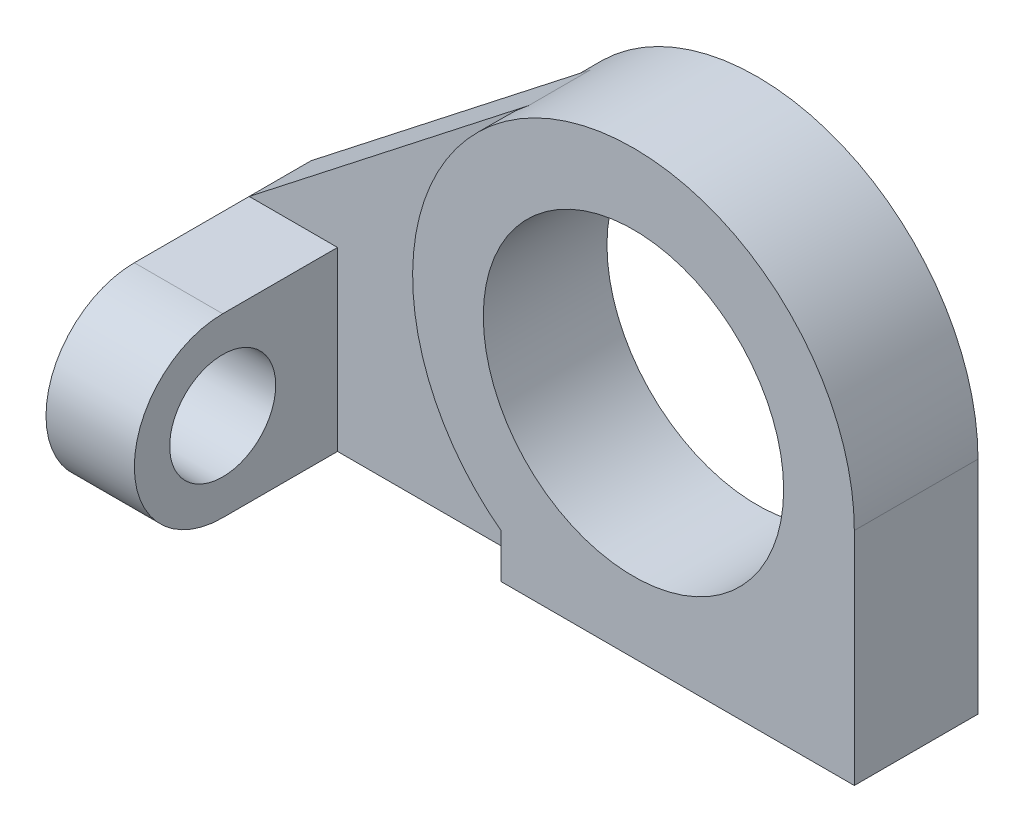
ISO-10303-21;
HEADER;
FILE_DESCRIPTION(('STEP AP214'),'2;1');
FILE_NAME('part.step','',(''),(''),'','','');
FILE_SCHEMA(('AUTOMOTIVE_DESIGN { 1 0 10303 214 1 1 1 1 }'));
ENDSEC;
DATA;
#1=APPLICATION_CONTEXT('core data for automotive mechanical design processes');
#2=APPLICATION_PROTOCOL_DEFINITION('international standard','automotive_design',2000,#1);
#3=PRODUCT_CONTEXT('',#1,'mechanical');
#4=PRODUCT('Part','Part','',(#3));
#5=PRODUCT_RELATED_PRODUCT_CATEGORY('part','',(#4));
#6=PRODUCT_DEFINITION_FORMATION('','',#4);
#7=PRODUCT_DEFINITION_CONTEXT('part definition',#1,'design');
#8=PRODUCT_DEFINITION('design','',#6,#7);
#9=PRODUCT_DEFINITION_SHAPE('','',#8);
#10=(LENGTH_UNIT() NAMED_UNIT(*) SI_UNIT(.MILLI.,.METRE.));
#11=(NAMED_UNIT(*) PLANE_ANGLE_UNIT() SI_UNIT($,.RADIAN.));
#12=(NAMED_UNIT(*) SI_UNIT($,.STERADIAN.) SOLID_ANGLE_UNIT());
#13=UNCERTAINTY_MEASURE_WITH_UNIT(LENGTH_MEASURE(1.E-05),#10,'distance_accuracy_value','');
#14=(GEOMETRIC_REPRESENTATION_CONTEXT(3) GLOBAL_UNCERTAINTY_ASSIGNED_CONTEXT((#13)) GLOBAL_UNIT_ASSIGNED_CONTEXT((#10,
#11,#12)) REPRESENTATION_CONTEXT('',''));
#15=CARTESIAN_POINT('',(0.,0.,0.));
#16=DIRECTION('',(0.,0.,1.));
#17=DIRECTION('',(1.,0.,0.));
#18=AXIS2_PLACEMENT_3D('',#15,#16,#17);
#19=CARTESIAN_POINT('',(15.,25.,14.));
#20=DIRECTION('',(0.,0.,-1.));
#21=DIRECTION('',(-1.,0.,0.));
#22=AXIS2_PLACEMENT_3D('',#19,#20,#21);
#23=CYLINDRICAL_SURFACE('',#22,24.9999999999999);
#24=CARTESIAN_POINT('',(15.0000000000002,25.,10.5));
#25=DIRECTION('',(0.,0.,-1.));
#26=DIRECTION('',(-1.,0.,0.));
#27=AXIS2_PLACEMENT_3D('',#24,#25,#26);
#28=CIRCLE('',#27,25.);
#29=CARTESIAN_POINT('',(0.,5.00000000000007,10.5));
#30=VERTEX_POINT('',#29);
#31=CARTESIAN_POINT('',(-0.393483786943977,44.6987475972736,10.5));
#32=VERTEX_POINT('',#31);
#33=EDGE_CURVE('E264',#30,#32,#28,.T.);
#34=ORIENTED_EDGE('',*,*,#33,.F.);
#35=DIRECTION('',(0.,0.,-1.));
#36=VECTOR('',#35,1.);
#37=CARTESIAN_POINT('',(0.,4.99999999999999,14.));
#38=LINE('',#37,#36);
#39=CARTESIAN_POINT('',(0.,5.00000000000007,14.));
#40=VERTEX_POINT('',#39);
#41=EDGE_CURVE('E321',#40,#30,#38,.T.);
#42=ORIENTED_EDGE('',*,*,#41,.F.);
#43=CARTESIAN_POINT('',(15.,25.,14.));
#44=DIRECTION('',(0.,0.,1.));
#45=DIRECTION('',(1.,0.,0.));
#46=AXIS2_PLACEMENT_3D('',#43,#44,#45);
#47=CIRCLE('',#46,24.9999999999999);
#48=CARTESIAN_POINT('',(40.,25.,14.));
#49=VERTEX_POINT('',#48);
#50=EDGE_CURVE('E72',#49,#40,#47,.T.);
#51=ORIENTED_EDGE('',*,*,#50,.F.);
#52=DIRECTION('',(0.,0.,-1.));
#53=VECTOR('',#52,1.);
#54=CARTESIAN_POINT('',(40.,25.,14.));
#55=LINE('',#54,#53);
#56=CARTESIAN_POINT('',(40.,25.,0.));
#57=VERTEX_POINT('',#56);
#58=EDGE_CURVE('E287',#49,#57,#55,.T.);
#59=ORIENTED_EDGE('',*,*,#58,.T.);
#60=CARTESIAN_POINT('',(15.,25.,0.));
#61=DIRECTION('',(0.,0.,1.));
#62=DIRECTION('',(1.,0.,0.));
#63=AXIS2_PLACEMENT_3D('',#60,#61,#62);
#64=CIRCLE('',#63,24.9999999999999);
#65=CARTESIAN_POINT('',(0.,5.00000000000007,0.));
#66=VERTEX_POINT('',#65);
#67=EDGE_CURVE('E325',#57,#66,#64,.T.);
#68=ORIENTED_EDGE('',*,*,#67,.T.);
#69=CARTESIAN_POINT('',(0.,5.00000000000007,3.5));
#70=VERTEX_POINT('',#69);
#71=EDGE_CURVE('E320',#70,#66,#38,.T.);
#72=ORIENTED_EDGE('',*,*,#71,.F.);
#73=CARTESIAN_POINT('',(15.0000000000002,25.,3.5));
#74=DIRECTION('',(0.,0.,-1.));
#75=DIRECTION('',(-1.,0.,0.));
#76=AXIS2_PLACEMENT_3D('',#73,#74,#75);
#77=CIRCLE('',#76,25.);
#78=CARTESIAN_POINT('',(-0.393483786943977,44.6987475972736,3.5));
#79=VERTEX_POINT('',#78);
#80=EDGE_CURVE('E275',#70,#79,#77,.T.);
#81=ORIENTED_EDGE('',*,*,#80,.T.);
#82=DIRECTION('',(0.,0.,-1.));
#83=VECTOR('',#82,1.);
#84=CARTESIAN_POINT('',(-0.393483786943977,44.6987475972736,10.5));
#85=LINE('',#84,#83);
#86=EDGE_CURVE('E284',#32,#79,#85,.T.);
#87=ORIENTED_EDGE('',*,*,#86,.F.);
#88=EDGE_LOOP('',(#34,#42,#51,#59,#68,#72,#81,#87));
#89=FACE_BOUND('',#88,.T.);
#90=ADVANCED_FACE('F63',(#89),#23,.T.);
#91=CARTESIAN_POINT('',(0.,0.,14.));
#92=DIRECTION('',(-1.,0.,0.));
#93=DIRECTION('',(0.,-1.,0.));
#94=AXIS2_PLACEMENT_3D('',#91,#92,#93);
#95=PLANE('',#94);
#96=ORIENTED_EDGE('',*,*,#41,.T.);
#97=DIRECTION('',(0.,1.,0.));
#98=VECTOR('',#97,1.);
#99=CARTESIAN_POINT('',(0.,0.,10.5));
#100=LINE('',#99,#98);
#101=CARTESIAN_POINT('',(0.,0.,10.5));
#102=VERTEX_POINT('',#101);
#103=EDGE_CURVE('E261',#102,#30,#100,.T.);
#104=ORIENTED_EDGE('',*,*,#103,.F.);
#105=DIRECTION('',(0.,0.,-1.));
#106=VECTOR('',#105,1.);
#107=CARTESIAN_POINT('',(0.,0.,14.));
#108=LINE('',#107,#106);
#109=CARTESIAN_POINT('',(0.,0.,14.));
#110=VERTEX_POINT('',#109);
#111=EDGE_CURVE('E316',#110,#102,#108,.T.);
#112=ORIENTED_EDGE('',*,*,#111,.F.);
#113=DIRECTION('',(0.,1.,0.));
#114=VECTOR('',#113,1.);
#115=CARTESIAN_POINT('',(0.,0.,14.));
#116=LINE('',#115,#114);
#117=EDGE_CURVE('E302',#110,#40,#116,.T.);
#118=ORIENTED_EDGE('',*,*,#117,.T.);
#119=EDGE_LOOP('',(#96,#104,#112,#118));
#120=FACE_BOUND('',#119,.T.);
#121=ADVANCED_FACE('F340',(#120),#95,.T.);
#122=CARTESIAN_POINT('',(15.,25.,14.));
#123=DIRECTION('',(0.,0.,-1.));
#124=DIRECTION('',(-1.,0.,0.));
#125=AXIS2_PLACEMENT_3D('',#122,#123,#124);
#126=CYLINDRICAL_SURFACE('',#125,17.);
#127=CARTESIAN_POINT('',(15.,25.,14.));
#128=DIRECTION('',(0.,0.,1.));
#129=DIRECTION('',(1.,0.,0.));
#130=AXIS2_PLACEMENT_3D('',#127,#128,#129);
#131=CIRCLE('',#130,17.);
#132=CARTESIAN_POINT('',(32.,25.,14.));
#133=VERTEX_POINT('',#132);
#134=EDGE_CURVE('E12',#133,#133,#131,.T.);
#135=ORIENTED_EDGE('',*,*,#134,.T.);
#136=EDGE_LOOP('',(#135));
#137=FACE_BOUND('',#136,.T.);
#138=CARTESIAN_POINT('',(15.,25.,0.));
#139=DIRECTION('',(0.,0.,1.));
#140=DIRECTION('',(1.,0.,0.));
#141=AXIS2_PLACEMENT_3D('',#138,#139,#140);
#142=CIRCLE('',#141,17.);
#143=CARTESIAN_POINT('',(32.,25.,0.));
#144=VERTEX_POINT('',#143);
#145=EDGE_CURVE('E66',#144,#144,#142,.T.);
#146=ORIENTED_EDGE('',*,*,#145,.F.);
#147=EDGE_LOOP('',(#146));
#148=FACE_BOUND('',#147,.T.);
#149=ADVANCED_FACE('F337',(#137,#148),#126,.F.);
#150=CARTESIAN_POINT('',(0.,0.,14.));
#151=DIRECTION('',(0.,0.,1.));
#152=DIRECTION('',(1.,0.,0.));
#153=AXIS2_PLACEMENT_3D('',#150,#151,#152);
#154=PLANE('',#153);
#155=DIRECTION('',(1.,0.,0.));
#156=VECTOR('',#155,1.);
#157=CARTESIAN_POINT('',(0.,0.,14.));
#158=LINE('',#157,#156);
#159=CARTESIAN_POINT('',(40.,0.,14.));
#160=VERTEX_POINT('',#159);
#161=EDGE_CURVE('E306',#110,#160,#158,.T.);
#162=ORIENTED_EDGE('',*,*,#161,.T.);
#163=DIRECTION('',(0.,1.,0.));
#164=VECTOR('',#163,1.);
#165=CARTESIAN_POINT('',(40.,0.,14.));
#166=LINE('',#165,#164);
#167=EDGE_CURVE('E292',#160,#49,#166,.T.);
#168=ORIENTED_EDGE('',*,*,#167,.T.);
#169=ORIENTED_EDGE('',*,*,#50,.T.);
#170=ORIENTED_EDGE('',*,*,#117,.F.);
#171=EDGE_LOOP('',(#162,#168,#169,#170));
#172=FACE_BOUND('',#171,.T.);
#173=ORIENTED_EDGE('',*,*,#134,.F.);
#174=EDGE_LOOP('',(#173));
#175=FACE_BOUND('',#174,.T.);
#176=ADVANCED_FACE('F339',(#172,#175),#154,.T.);
#177=CARTESIAN_POINT('',(0.,0.,0.));
#178=DIRECTION('',(0.,0.,1.));
#179=DIRECTION('',(1.,0.,0.));
#180=AXIS2_PLACEMENT_3D('',#177,#178,#179);
#181=PLANE('',#180);
#182=ORIENTED_EDGE('',*,*,#67,.F.);
#183=DIRECTION('',(0.,1.,0.));
#184=VECTOR('',#183,1.);
#185=CARTESIAN_POINT('',(40.,0.,0.));
#186=LINE('',#185,#184);
#187=CARTESIAN_POINT('',(40.,0.,0.));
#188=VERTEX_POINT('',#187);
#189=EDGE_CURVE('E293',#188,#57,#186,.T.);
#190=ORIENTED_EDGE('',*,*,#189,.F.);
#191=DIRECTION('',(1.,0.,0.));
#192=VECTOR('',#191,1.);
#193=CARTESIAN_POINT('',(0.,0.,0.));
#194=LINE('',#193,#192);
#195=CARTESIAN_POINT('',(0.,0.,0.));
#196=VERTEX_POINT('',#195);
#197=EDGE_CURVE('E307',#196,#188,#194,.T.);
#198=ORIENTED_EDGE('',*,*,#197,.F.);
#199=DIRECTION('',(0.,1.,0.));
#200=VECTOR('',#199,1.);
#201=CARTESIAN_POINT('',(0.,0.,0.));
#202=LINE('',#201,#200);
#203=EDGE_CURVE('E301',#196,#66,#202,.T.);
#204=ORIENTED_EDGE('',*,*,#203,.T.);
#205=EDGE_LOOP('',(#182,#190,#198,#204));
#206=FACE_BOUND('',#205,.T.);
#207=ORIENTED_EDGE('',*,*,#145,.T.);
#208=EDGE_LOOP('',(#207));
#209=FACE_BOUND('',#208,.T.);
#210=ADVANCED_FACE('F335',(#206,#209),#181,.F.);
#211=DIRECTION('',(0.,1.,0.));
#212=VECTOR('',#211,1.);
#213=CARTESIAN_POINT('',(0.,0.,3.5));
#214=LINE('',#213,#212);
#215=CARTESIAN_POINT('',(0.,0.,3.5));
#216=VERTEX_POINT('',#215);
#217=EDGE_CURVE('E80',#216,#70,#214,.T.);
#218=ORIENTED_EDGE('',*,*,#217,.T.);
#219=ORIENTED_EDGE('',*,*,#71,.T.);
#220=ORIENTED_EDGE('',*,*,#203,.F.);
#221=EDGE_CURVE('E310',#216,#196,#108,.T.);
#222=ORIENTED_EDGE('',*,*,#221,.F.);
#223=EDGE_LOOP('',(#218,#219,#220,#222));
#224=FACE_BOUND('',#223,.T.);
#225=ADVANCED_FACE('F350',(#224),#95,.T.);
#226=CARTESIAN_POINT('',(0.,0.,14.));
#227=DIRECTION('',(0.,1.,0.));
#228=DIRECTION('',(0.,0.,1.));
#229=AXIS2_PLACEMENT_3D('',#226,#227,#228);
#230=PLANE('',#229);
#231=ORIENTED_EDGE('',*,*,#197,.T.);
#232=DIRECTION('',(0.,0.,-1.));
#233=VECTOR('',#232,1.);
#234=CARTESIAN_POINT('',(40.,0.,14.));
#235=LINE('',#234,#233);
#236=EDGE_CURVE('E288',#160,#188,#235,.T.);
#237=ORIENTED_EDGE('',*,*,#236,.F.);
#238=ORIENTED_EDGE('',*,*,#161,.F.);
#239=ORIENTED_EDGE('',*,*,#111,.T.);
#240=DIRECTION('',(1.,0.,0.));
#241=VECTOR('',#240,1.);
#242=CARTESIAN_POINT('',(-22.,0.,10.5));
#243=LINE('',#242,#241);
#244=CARTESIAN_POINT('',(-22.,0.,10.5));
#245=VERTEX_POINT('',#244);
#246=EDGE_CURVE('E258',#245,#102,#243,.T.);
#247=ORIENTED_EDGE('',*,*,#246,.F.);
#248=DIRECTION('',(0.,0.,1.));
#249=VECTOR('',#248,1.);
#250=CARTESIAN_POINT('',(-22.,0.,0.));
#251=LINE('',#250,#249);
#252=CARTESIAN_POINT('',(-22.,0.,23.5));
#253=VERTEX_POINT('',#252);
#254=EDGE_CURVE('E225',#245,#253,#251,.T.);
#255=ORIENTED_EDGE('',*,*,#254,.T.);
#256=DIRECTION('',(-1.,0.,0.));
#257=VECTOR('',#256,1.);
#258=CARTESIAN_POINT('',(-22.,0.,23.5));
#259=LINE('',#258,#257);
#260=CARTESIAN_POINT('',(-32.,0.,23.5));
#261=VERTEX_POINT('',#260);
#262=EDGE_CURVE('E228',#253,#261,#259,.T.);
#263=ORIENTED_EDGE('',*,*,#262,.T.);
#264=DIRECTION('',(0.,0.,1.));
#265=VECTOR('',#264,1.);
#266=CARTESIAN_POINT('',(-32.,0.,0.));
#267=LINE('',#266,#265);
#268=CARTESIAN_POINT('',(-32.,0.,10.5));
#269=VERTEX_POINT('',#268);
#270=EDGE_CURVE('E245',#269,#261,#267,.T.);
#271=ORIENTED_EDGE('',*,*,#270,.F.);
#272=DIRECTION('',(1.,0.,0.));
#273=VECTOR('',#272,1.);
#274=CARTESIAN_POINT('',(-36.,0.,10.5));
#275=LINE('',#274,#273);
#276=CARTESIAN_POINT('',(-36.,0.,10.5));
#277=VERTEX_POINT('',#276);
#278=EDGE_CURVE('E201',#277,#269,#275,.T.);
#279=ORIENTED_EDGE('',*,*,#278,.F.);
#280=DIRECTION('',(0.,0.,-1.));
#281=VECTOR('',#280,1.);
#282=CARTESIAN_POINT('',(-36.,0.,3.5));
#283=LINE('',#282,#281);
#284=CARTESIAN_POINT('',(-36.,0.,3.5));
#285=VERTEX_POINT('',#284);
#286=EDGE_CURVE('E179',#277,#285,#283,.T.);
#287=ORIENTED_EDGE('',*,*,#286,.T.);
#288=DIRECTION('',(1.,0.,0.));
#289=VECTOR('',#288,1.);
#290=CARTESIAN_POINT('',(-22.,0.,3.5));
#291=LINE('',#290,#289);
#292=EDGE_CURVE('E193',#285,#216,#291,.T.);
#293=ORIENTED_EDGE('',*,*,#292,.T.);
#294=ORIENTED_EDGE('',*,*,#221,.T.);
#295=EDGE_LOOP('',(#231,#237,#238,#239,#247,#255,#263,#271,#279,#287,#293,#294));
#296=FACE_BOUND('',#295,.T.);
#297=ADVANCED_FACE('F377',(#296),#230,.F.);
#298=CARTESIAN_POINT('',(40.,0.,14.));
#299=DIRECTION('',(-1.,0.,0.));
#300=DIRECTION('',(0.,0.,1.));
#301=AXIS2_PLACEMENT_3D('',#298,#299,#300);
#302=PLANE('',#301);
#303=ORIENTED_EDGE('',*,*,#189,.T.);
#304=ORIENTED_EDGE('',*,*,#58,.F.);
#305=ORIENTED_EDGE('',*,*,#167,.F.);
#306=ORIENTED_EDGE('',*,*,#236,.T.);
#307=EDGE_LOOP('',(#303,#304,#305,#306));
#308=FACE_BOUND('',#307,.T.);
#309=ADVANCED_FACE('F367',(#308),#302,.F.);
#310=CARTESIAN_POINT('',(-32.,20.,10.5));
#311=DIRECTION('',(0.61573935147776,-0.787949903890944,0.));
#312=DIRECTION('',(0.787949903890944,0.61573935147776,0.));
#313=AXIS2_PLACEMENT_3D('',#310,#311,#312);
#314=PLANE('',#313);
#315=DIRECTION('',(-0.787949903890944,-0.61573935147776,0.));
#316=VECTOR('',#315,1.);
#317=CARTESIAN_POINT('',(-32.,20.,3.5));
#318=LINE('',#317,#316);
#319=CARTESIAN_POINT('',(-32.,20.,3.5));
#320=VERTEX_POINT('',#319);
#321=EDGE_CURVE('E255',#79,#320,#318,.T.);
#322=ORIENTED_EDGE('',*,*,#321,.T.);
#323=DIRECTION('',(0.,0.,-1.));
#324=VECTOR('',#323,1.);
#325=CARTESIAN_POINT('',(-32.,20.,10.5));
#326=LINE('',#325,#324);
#327=CARTESIAN_POINT('',(-32.,20.,10.5));
#328=VERTEX_POINT('',#327);
#329=EDGE_CURVE('E270',#328,#320,#326,.T.);
#330=ORIENTED_EDGE('',*,*,#329,.F.);
#331=DIRECTION('',(-0.787949903890944,-0.61573935147776,0.));
#332=VECTOR('',#331,1.);
#333=CARTESIAN_POINT('',(-32.,20.,10.5));
#334=LINE('',#333,#332);
#335=EDGE_CURVE('E267',#32,#328,#334,.T.);
#336=ORIENTED_EDGE('',*,*,#335,.F.);
#337=ORIENTED_EDGE('',*,*,#86,.T.);
#338=EDGE_LOOP('',(#322,#330,#336,#337));
#339=FACE_BOUND('',#338,.T.);
#340=ADVANCED_FACE('F389',(#339),#314,.F.);
#341=CARTESIAN_POINT('',(15.0000000000002,25.,10.5));
#342=DIRECTION('',(0.,0.,-1.));
#343=DIRECTION('',(-1.,0.,0.));
#344=AXIS2_PLACEMENT_3D('',#341,#342,#343);
#345=PLANE('',#344);
#346=DIRECTION('',(1.,0.,0.));
#347=VECTOR('',#346,1.);
#348=CARTESIAN_POINT('',(-32.,20.,10.5));
#349=LINE('',#348,#347);
#350=CARTESIAN_POINT('',(-22.,20.,10.5));
#351=VERTEX_POINT('',#350);
#352=EDGE_CURVE('E251',#328,#351,#349,.T.);
#353=ORIENTED_EDGE('',*,*,#352,.T.);
#354=DIRECTION('',(0.,-1.,0.));
#355=VECTOR('',#354,1.);
#356=CARTESIAN_POINT('',(-22.,20.,10.5));
#357=LINE('',#356,#355);
#358=EDGE_CURVE('E254',#351,#245,#357,.T.);
#359=ORIENTED_EDGE('',*,*,#358,.T.);
#360=ORIENTED_EDGE('',*,*,#246,.T.);
#361=ORIENTED_EDGE('',*,*,#103,.T.);
#362=ORIENTED_EDGE('',*,*,#33,.T.);
#363=ORIENTED_EDGE('',*,*,#335,.T.);
#364=EDGE_LOOP('',(#353,#359,#360,#361,#362,#363));
#365=FACE_BOUND('',#364,.T.);
#366=ADVANCED_FACE('F391',(#365),#345,.F.);
#367=CARTESIAN_POINT('',(15.0000000000002,25.,3.5));
#368=DIRECTION('',(0.,0.,-1.));
#369=DIRECTION('',(-1.,0.,0.));
#370=AXIS2_PLACEMENT_3D('',#367,#368,#369);
#371=PLANE('',#370);
#372=DIRECTION('',(0.,1.,0.));
#373=VECTOR('',#372,1.);
#374=CARTESIAN_POINT('',(-32.,0.,3.5));
#375=LINE('',#374,#373);
#376=CARTESIAN_POINT('',(-32.,16.,3.5));
#377=VERTEX_POINT('',#376);
#378=EDGE_CURVE('E248',#377,#320,#375,.T.);
#379=ORIENTED_EDGE('',*,*,#378,.T.);
#380=ORIENTED_EDGE('',*,*,#321,.F.);
#381=ORIENTED_EDGE('',*,*,#80,.F.);
#382=ORIENTED_EDGE('',*,*,#217,.F.);
#383=ORIENTED_EDGE('',*,*,#292,.F.);
#384=DIRECTION('',(0.,1.,0.));
#385=VECTOR('',#384,1.);
#386=CARTESIAN_POINT('',(-36.,0.,3.5));
#387=LINE('',#386,#385);
#388=CARTESIAN_POINT('',(-36.,16.,3.5));
#389=VERTEX_POINT('',#388);
#390=EDGE_CURVE('E186',#285,#389,#387,.T.);
#391=ORIENTED_EDGE('',*,*,#390,.T.);
#392=DIRECTION('',(1.,0.,0.));
#393=VECTOR('',#392,1.);
#394=CARTESIAN_POINT('',(-36.,16.,3.5));
#395=LINE('',#394,#393);
#396=EDGE_CURVE('E168',#389,#377,#395,.T.);
#397=ORIENTED_EDGE('',*,*,#396,.T.);
#398=EDGE_LOOP('',(#379,#380,#381,#382,#383,#391,#397));
#399=FACE_BOUND('',#398,.T.);
#400=ADVANCED_FACE('F192',(#399),#371,.T.);
#401=CARTESIAN_POINT('',(-22.,20.,0.));
#402=DIRECTION('',(0.,-1.,0.));
#403=DIRECTION('',(0.,0.,-1.));
#404=AXIS2_PLACEMENT_3D('',#401,#402,#403);
#405=PLANE('',#404);
#406=DIRECTION('',(0.,0.,1.));
#407=VECTOR('',#406,1.);
#408=CARTESIAN_POINT('',(-22.,20.,0.));
#409=LINE('',#408,#407);
#410=CARTESIAN_POINT('',(-22.,20.,23.5));
#411=VERTEX_POINT('',#410);
#412=EDGE_CURVE('E217',#351,#411,#409,.T.);
#413=ORIENTED_EDGE('',*,*,#412,.F.);
#414=ORIENTED_EDGE('',*,*,#352,.F.);
#415=DIRECTION('',(0.,0.,1.));
#416=VECTOR('',#415,1.);
#417=CARTESIAN_POINT('',(-32.,20.,0.));
#418=LINE('',#417,#416);
#419=CARTESIAN_POINT('',(-32.,20.,23.5));
#420=VERTEX_POINT('',#419);
#421=EDGE_CURVE('E232',#328,#420,#418,.T.);
#422=ORIENTED_EDGE('',*,*,#421,.T.);
#423=DIRECTION('',(-1.,0.,0.));
#424=VECTOR('',#423,1.);
#425=CARTESIAN_POINT('',(-22.,20.,23.5));
#426=LINE('',#425,#424);
#427=EDGE_CURVE('E241',#411,#420,#426,.T.);
#428=ORIENTED_EDGE('',*,*,#427,.F.);
#429=EDGE_LOOP('',(#413,#414,#422,#428));
#430=FACE_BOUND('',#429,.T.);
#431=ADVANCED_FACE('F401',(#430),#405,.F.);
#432=CARTESIAN_POINT('',(-22.,0.,0.));
#433=DIRECTION('',(1.,0.,0.));
#434=DIRECTION('',(0.,0.,-1.));
#435=AXIS2_PLACEMENT_3D('',#432,#433,#434);
#436=PLANE('',#435);
#437=CARTESIAN_POINT('',(-22.,10.,23.5));
#438=DIRECTION('',(1.,0.,0.));
#439=DIRECTION('',(0.,0.,-1.));
#440=AXIS2_PLACEMENT_3D('',#437,#438,#439);
#441=CIRCLE('',#440,6.);
#442=CARTESIAN_POINT('',(-22.,10.,17.5));
#443=VERTEX_POINT('',#442);
#444=EDGE_CURVE('E213',#443,#443,#441,.T.);
#445=ORIENTED_EDGE('',*,*,#444,.F.);
#446=EDGE_LOOP('',(#445));
#447=FACE_BOUND('',#446,.T.);
#448=ORIENTED_EDGE('',*,*,#358,.F.);
#449=ORIENTED_EDGE('',*,*,#412,.T.);
#450=CARTESIAN_POINT('',(-22.,10.,23.5));
#451=DIRECTION('',(1.,0.,0.));
#452=DIRECTION('',(0.,0.,-1.));
#453=AXIS2_PLACEMENT_3D('',#450,#451,#452);
#454=CIRCLE('',#453,10.);
#455=EDGE_CURVE('E221',#411,#253,#454,.T.);
#456=ORIENTED_EDGE('',*,*,#455,.T.);
#457=ORIENTED_EDGE('',*,*,#254,.F.);
#458=EDGE_LOOP('',(#448,#449,#456,#457));
#459=FACE_BOUND('',#458,.T.);
#460=ADVANCED_FACE('F398',(#447,#459),#436,.T.);
#461=CARTESIAN_POINT('',(-32.,0.,0.));
#462=DIRECTION('',(1.,0.,0.));
#463=DIRECTION('',(0.,0.,-1.));
#464=AXIS2_PLACEMENT_3D('',#461,#462,#463);
#465=PLANE('',#464);
#466=DIRECTION('',(0.,0.,1.));
#467=VECTOR('',#466,1.);
#468=CARTESIAN_POINT('',(-32.,16.,0.));
#469=LINE('',#468,#467);
#470=CARTESIAN_POINT('',(-32.,16.,10.5));
#471=VERTEX_POINT('',#470);
#472=EDGE_CURVE('E173',#377,#471,#469,.T.);
#473=ORIENTED_EDGE('',*,*,#472,.T.);
#474=DIRECTION('',(0.,-1.,0.));
#475=VECTOR('',#474,1.);
#476=CARTESIAN_POINT('',(-32.,0.,10.5));
#477=LINE('',#476,#475);
#478=EDGE_CURVE('E208',#471,#269,#477,.T.);
#479=ORIENTED_EDGE('',*,*,#478,.T.);
#480=ORIENTED_EDGE('',*,*,#270,.T.);
#481=CARTESIAN_POINT('',(-32.,10.,23.5));
#482=DIRECTION('',(1.,0.,0.));
#483=DIRECTION('',(0.,0.,-1.));
#484=AXIS2_PLACEMENT_3D('',#481,#482,#483);
#485=CIRCLE('',#484,10.);
#486=EDGE_CURVE('E218',#420,#261,#485,.T.);
#487=ORIENTED_EDGE('',*,*,#486,.F.);
#488=ORIENTED_EDGE('',*,*,#421,.F.);
#489=ORIENTED_EDGE('',*,*,#329,.T.);
#490=ORIENTED_EDGE('',*,*,#378,.F.);
#491=EDGE_LOOP('',(#473,#479,#480,#487,#488,#489,#490));
#492=FACE_BOUND('',#491,.T.);
#493=CARTESIAN_POINT('',(-32.,10.,23.5));
#494=DIRECTION('',(1.,0.,0.));
#495=DIRECTION('',(0.,0.,-1.));
#496=AXIS2_PLACEMENT_3D('',#493,#494,#495);
#497=CIRCLE('',#496,6.);
#498=CARTESIAN_POINT('',(-32.,10.,17.5));
#499=VERTEX_POINT('',#498);
#500=EDGE_CURVE('E212',#499,#499,#497,.T.);
#501=ORIENTED_EDGE('',*,*,#500,.T.);
#502=EDGE_LOOP('',(#501));
#503=FACE_BOUND('',#502,.T.);
#504=ADVANCED_FACE('F383',(#492,#503),#465,.F.);
#505=CARTESIAN_POINT('',(-22.,10.,23.5));
#506=DIRECTION('',(-1.,0.,0.));
#507=DIRECTION('',(0.,0.,1.));
#508=AXIS2_PLACEMENT_3D('',#505,#506,#507);
#509=CYLINDRICAL_SURFACE('',#508,10.);
#510=ORIENTED_EDGE('',*,*,#486,.T.);
#511=ORIENTED_EDGE('',*,*,#262,.F.);
#512=ORIENTED_EDGE('',*,*,#455,.F.);
#513=ORIENTED_EDGE('',*,*,#427,.T.);
#514=EDGE_LOOP('',(#510,#511,#512,#513));
#515=FACE_BOUND('',#514,.T.);
#516=ADVANCED_FACE('F404',(#515),#509,.T.);
#517=CARTESIAN_POINT('',(-22.,10.,23.5));
#518=DIRECTION('',(-1.,0.,0.));
#519=DIRECTION('',(0.,0.,1.));
#520=AXIS2_PLACEMENT_3D('',#517,#518,#519);
#521=CYLINDRICAL_SURFACE('',#520,6.);
#522=ORIENTED_EDGE('',*,*,#444,.T.);
#523=EDGE_LOOP('',(#522));
#524=FACE_BOUND('',#523,.T.);
#525=ORIENTED_EDGE('',*,*,#500,.F.);
#526=EDGE_LOOP('',(#525));
#527=FACE_BOUND('',#526,.T.);
#528=ADVANCED_FACE('F407',(#524,#527),#521,.F.);
#529=CARTESIAN_POINT('',(-36.,0.,10.5));
#530=DIRECTION('',(0.,0.,1.));
#531=DIRECTION('',(1.,0.,0.));
#532=AXIS2_PLACEMENT_3D('',#529,#530,#531);
#533=PLANE('',#532);
#534=ORIENTED_EDGE('',*,*,#478,.F.);
#535=DIRECTION('',(1.,0.,0.));
#536=VECTOR('',#535,1.);
#537=CARTESIAN_POINT('',(-36.,16.,10.5));
#538=LINE('',#537,#536);
#539=CARTESIAN_POINT('',(-36.,16.,10.5));
#540=VERTEX_POINT('',#539);
#541=EDGE_CURVE('E178',#540,#471,#538,.T.);
#542=ORIENTED_EDGE('',*,*,#541,.F.);
#543=DIRECTION('',(0.,-1.,0.));
#544=VECTOR('',#543,1.);
#545=CARTESIAN_POINT('',(-36.,0.,10.5));
#546=LINE('',#545,#544);
#547=EDGE_CURVE('E189',#540,#277,#546,.T.);
#548=ORIENTED_EDGE('',*,*,#547,.T.);
#549=ORIENTED_EDGE('',*,*,#278,.T.);
#550=EDGE_LOOP('',(#534,#542,#548,#549));
#551=FACE_BOUND('',#550,.T.);
#552=ADVANCED_FACE('F381',(#551),#533,.T.);
#553=CARTESIAN_POINT('',(-36.,16.,3.5));
#554=DIRECTION('',(0.,1.,0.));
#555=DIRECTION('',(0.,0.,1.));
#556=AXIS2_PLACEMENT_3D('',#553,#554,#555);
#557=PLANE('',#556);
#558=ORIENTED_EDGE('',*,*,#472,.F.);
#559=ORIENTED_EDGE('',*,*,#396,.F.);
#560=DIRECTION('',(0.,0.,1.));
#561=VECTOR('',#560,1.);
#562=CARTESIAN_POINT('',(-36.,16.,3.5));
#563=LINE('',#562,#561);
#564=EDGE_CURVE('E171',#389,#540,#563,.T.);
#565=ORIENTED_EDGE('',*,*,#564,.T.);
#566=ORIENTED_EDGE('',*,*,#541,.T.);
#567=EDGE_LOOP('',(#558,#559,#565,#566));
#568=FACE_BOUND('',#567,.T.);
#569=ADVANCED_FACE('F170',(#568),#557,.T.);
#570=CARTESIAN_POINT('',(-36.,0.,0.));
#571=DIRECTION('',(1.,0.,0.));
#572=DIRECTION('',(0.,0.,-1.));
#573=AXIS2_PLACEMENT_3D('',#570,#571,#572);
#574=PLANE('',#573);
#575=ORIENTED_EDGE('',*,*,#390,.F.);
#576=ORIENTED_EDGE('',*,*,#286,.F.);
#577=ORIENTED_EDGE('',*,*,#547,.F.);
#578=ORIENTED_EDGE('',*,*,#564,.F.);
#579=EDGE_LOOP('',(#575,#576,#577,#578));
#580=FACE_BOUND('',#579,.T.);
#581=ADVANCED_FACE('F184',(#580),#574,.F.);
#582=CLOSED_SHELL('',(#90,#121,#149,#176,#210,#225,#297,#309,#340,#366,#400,#431,#460,#504,#516,
#528,#552,#569,#581));
#583=MANIFOLD_SOLID_BREP('B2',#582);
#584=ADVANCED_BREP_SHAPE_REPRESENTATION('',(#18,#583),#14);
#585=SHAPE_DEFINITION_REPRESENTATION(#9,#584);
ENDSEC;
END-ISO-10303-21;
